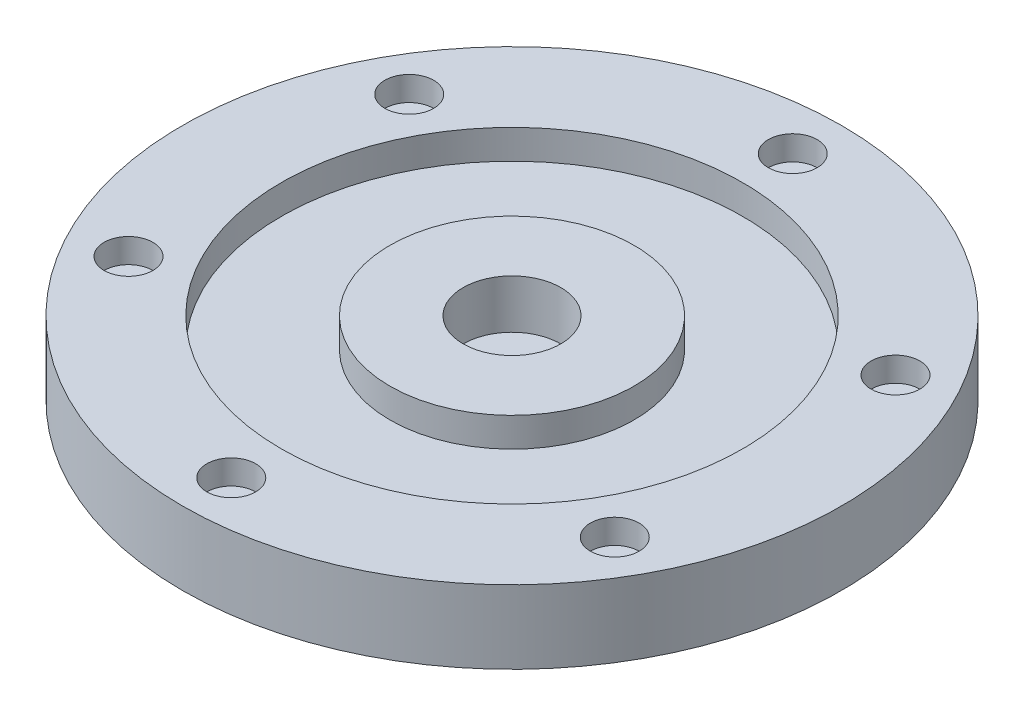
ISO-10303-21;
HEADER;
FILE_DESCRIPTION(('STEP AP214'),'2;1');
FILE_NAME('part.step','',(''),(''),'','','');
FILE_SCHEMA(('AUTOMOTIVE_DESIGN { 1 0 10303 214 1 1 1 1 }'));
ENDSEC;
DATA;
#1=APPLICATION_CONTEXT('core data for automotive mechanical design processes');
#2=APPLICATION_PROTOCOL_DEFINITION('international standard','automotive_design',2000,#1);
#3=PRODUCT_CONTEXT('',#1,'mechanical');
#4=PRODUCT('Part','Part','',(#3));
#5=PRODUCT_RELATED_PRODUCT_CATEGORY('part','',(#4));
#6=PRODUCT_DEFINITION_FORMATION('','',#4);
#7=PRODUCT_DEFINITION_CONTEXT('part definition',#1,'design');
#8=PRODUCT_DEFINITION('design','',#6,#7);
#9=PRODUCT_DEFINITION_SHAPE('','',#8);
#10=(LENGTH_UNIT() NAMED_UNIT(*) SI_UNIT(.MILLI.,.METRE.));
#11=(NAMED_UNIT(*) PLANE_ANGLE_UNIT() SI_UNIT($,.RADIAN.));
#12=(NAMED_UNIT(*) SI_UNIT($,.STERADIAN.) SOLID_ANGLE_UNIT());
#13=UNCERTAINTY_MEASURE_WITH_UNIT(LENGTH_MEASURE(1.E-05),#10,'distance_accuracy_value','');
#14=(GEOMETRIC_REPRESENTATION_CONTEXT(3) GLOBAL_UNCERTAINTY_ASSIGNED_CONTEXT((#13)) GLOBAL_UNIT_ASSIGNED_CONTEXT((#10,
#11,#12)) REPRESENTATION_CONTEXT('',''));
#15=CARTESIAN_POINT('',(0.,0.,0.));
#16=DIRECTION('',(0.,0.,1.));
#17=DIRECTION('',(1.,0.,0.));
#18=AXIS2_PLACEMENT_3D('',#15,#16,#17);
#19=CARTESIAN_POINT('',(-49.796460717604,0.,-28.7499999999978));
#20=DIRECTION('',(0.,1.,0.));
#21=DIRECTION('',(0.,0.,1.));
#22=AXIS2_PLACEMENT_3D('',#19,#20,#21);
#23=CYLINDRICAL_SURFACE('',#22,2.00000000000247);
#24=CARTESIAN_POINT('',(-49.796460717604,0.,-28.7499999999978));
#25=DIRECTION('',(0.,1.,0.));
#26=DIRECTION('',(0.,0.,1.));
#27=AXIS2_PLACEMENT_3D('',#24,#25,#26);
#28=CIRCLE('',#27,2.00000000000247);
#29=CARTESIAN_POINT('',(-49.796460717604,0.,-26.7499999999954));
#30=VERTEX_POINT('',#29);
#31=EDGE_CURVE('E57',#30,#30,#28,.T.);
#32=ORIENTED_EDGE('',*,*,#31,.F.);
#33=EDGE_LOOP('',(#32));
#34=FACE_BOUND('',#33,.T.);
#35=CARTESIAN_POINT('',(-49.796460717604,10.,-28.7499999999978));
#36=DIRECTION('',(0.,1.,0.));
#37=DIRECTION('',(0.,0.,1.));
#38=AXIS2_PLACEMENT_3D('',#35,#36,#37);
#39=CIRCLE('',#38,2.00000000000247);
#40=CARTESIAN_POINT('',(-49.796460717604,10.,-26.7499999999954));
#41=VERTEX_POINT('',#40);
#42=EDGE_CURVE('E39',#41,#41,#39,.F.);
#43=ORIENTED_EDGE('',*,*,#42,.F.);
#44=EDGE_LOOP('',(#43));
#45=FACE_BOUND('',#44,.T.);
#46=ADVANCED_FACE('F35',(#34,#45),#23,.F.);
#47=CARTESIAN_POINT('',(-49.7964607176015,0.,28.7500000000021));
#48=DIRECTION('',(0.,1.,0.));
#49=DIRECTION('',(0.,0.,1.));
#50=AXIS2_PLACEMENT_3D('',#47,#48,#49);
#51=CYLINDRICAL_SURFACE('',#50,2.00000000000465);
#52=CARTESIAN_POINT('',(-49.7964607176015,0.,28.7500000000021));
#53=DIRECTION('',(0.,1.,0.));
#54=DIRECTION('',(0.,0.,1.));
#55=AXIS2_PLACEMENT_3D('',#52,#53,#54);
#56=CIRCLE('',#55,2.00000000000465);
#57=CARTESIAN_POINT('',(-49.7964607176015,0.,30.7500000000068));
#58=VERTEX_POINT('',#57);
#59=EDGE_CURVE('E94',#58,#58,#56,.T.);
#60=ORIENTED_EDGE('',*,*,#59,.F.);
#61=EDGE_LOOP('',(#60));
#62=FACE_BOUND('',#61,.T.);
#63=CARTESIAN_POINT('',(-49.7964607176015,10.,28.7500000000021));
#64=DIRECTION('',(0.,1.,0.));
#65=DIRECTION('',(0.,0.,1.));
#66=AXIS2_PLACEMENT_3D('',#63,#64,#65);
#67=CIRCLE('',#66,2.00000000000465);
#68=CARTESIAN_POINT('',(-49.7964607176015,10.,30.7500000000068));
#69=VERTEX_POINT('',#68);
#70=EDGE_CURVE('E68',#69,#69,#67,.F.);
#71=ORIENTED_EDGE('',*,*,#70,.F.);
#72=EDGE_LOOP('',(#71));
#73=FACE_BOUND('',#72,.T.);
#74=ADVANCED_FACE('F147',(#62,#73),#51,.F.);
#75=CARTESIAN_POINT('',(4.8886614385545E-12,0.,57.5));
#76=DIRECTION('',(0.,1.,0.));
#77=DIRECTION('',(0.,0.,1.));
#78=AXIS2_PLACEMENT_3D('',#75,#76,#77);
#79=CYLINDRICAL_SURFACE('',#78,2.00000000000506);
#80=CARTESIAN_POINT('',(4.8886614385545E-12,0.,57.5));
#81=DIRECTION('',(0.,1.,0.));
#82=DIRECTION('',(0.,0.,1.));
#83=AXIS2_PLACEMENT_3D('',#80,#81,#82);
#84=CIRCLE('',#83,2.00000000000506);
#85=CARTESIAN_POINT('',(4.8886614385545E-12,0.,59.5000000000051));
#86=VERTEX_POINT('',#85);
#87=EDGE_CURVE('E91',#86,#86,#84,.T.);
#88=ORIENTED_EDGE('',*,*,#87,.F.);
#89=EDGE_LOOP('',(#88));
#90=FACE_BOUND('',#89,.T.);
#91=CARTESIAN_POINT('',(4.8886614385545E-12,10.,57.5));
#92=DIRECTION('',(0.,1.,0.));
#93=DIRECTION('',(0.,0.,1.));
#94=AXIS2_PLACEMENT_3D('',#91,#92,#93);
#95=CIRCLE('',#94,2.00000000000506);
#96=CARTESIAN_POINT('',(4.8886614385545E-12,10.,59.5000000000051));
#97=VERTEX_POINT('',#96);
#98=EDGE_CURVE('E66',#97,#97,#95,.F.);
#99=ORIENTED_EDGE('',*,*,#98,.F.);
#100=EDGE_LOOP('',(#99));
#101=FACE_BOUND('',#100,.T.);
#102=ADVANCED_FACE('F153',(#90,#101),#79,.F.);
#103=CARTESIAN_POINT('',(49.7964607176089,0.,28.7499999999979));
#104=DIRECTION('',(0.,1.,0.));
#105=DIRECTION('',(0.,0.,1.));
#106=AXIS2_PLACEMENT_3D('',#103,#104,#105);
#107=CYLINDRICAL_SURFACE('',#106,2.00000000000315);
#108=CARTESIAN_POINT('',(49.7964607176089,0.,28.7499999999979));
#109=DIRECTION('',(0.,1.,0.));
#110=DIRECTION('',(0.,0.,1.));
#111=AXIS2_PLACEMENT_3D('',#108,#109,#110);
#112=CIRCLE('',#111,2.00000000000315);
#113=CARTESIAN_POINT('',(49.7964607176089,0.,30.750000000001));
#114=VERTEX_POINT('',#113);
#115=EDGE_CURVE('E88',#114,#114,#112,.T.);
#116=ORIENTED_EDGE('',*,*,#115,.F.);
#117=EDGE_LOOP('',(#116));
#118=FACE_BOUND('',#117,.T.);
#119=CARTESIAN_POINT('',(49.7964607176089,10.,28.7499999999979));
#120=DIRECTION('',(0.,1.,0.));
#121=DIRECTION('',(0.,0.,1.));
#122=AXIS2_PLACEMENT_3D('',#119,#120,#121);
#123=CIRCLE('',#122,2.00000000000315);
#124=CARTESIAN_POINT('',(49.7964607176089,10.,30.750000000001));
#125=VERTEX_POINT('',#124);
#126=EDGE_CURVE('E62',#125,#125,#123,.F.);
#127=ORIENTED_EDGE('',*,*,#126,.F.);
#128=EDGE_LOOP('',(#127));
#129=FACE_BOUND('',#128,.T.);
#130=ADVANCED_FACE('F349',(#118,#129),#107,.F.);
#131=CARTESIAN_POINT('',(49.7964607176064,0.,-28.7500000000021));
#132=DIRECTION('',(0.,1.,0.));
#133=DIRECTION('',(0.,0.,1.));
#134=AXIS2_PLACEMENT_3D('',#131,#132,#133);
#135=CYLINDRICAL_SURFACE('',#134,2.0000000000007);
#136=CARTESIAN_POINT('',(49.7964607176064,0.,-28.7500000000021));
#137=DIRECTION('',(0.,1.,0.));
#138=DIRECTION('',(0.,0.,1.));
#139=AXIS2_PLACEMENT_3D('',#136,#137,#138);
#140=CIRCLE('',#139,2.0000000000007);
#141=CARTESIAN_POINT('',(49.7964607176064,0.,-26.7500000000014));
#142=VERTEX_POINT('',#141);
#143=EDGE_CURVE('E84',#142,#142,#140,.T.);
#144=ORIENTED_EDGE('',*,*,#143,.F.);
#145=EDGE_LOOP('',(#144));
#146=FACE_BOUND('',#145,.T.);
#147=CARTESIAN_POINT('',(49.7964607176064,10.,-28.7500000000021));
#148=DIRECTION('',(0.,1.,0.));
#149=DIRECTION('',(0.,0.,1.));
#150=AXIS2_PLACEMENT_3D('',#147,#148,#149);
#151=CIRCLE('',#150,2.0000000000007);
#152=CARTESIAN_POINT('',(49.7964607176064,10.,-26.7500000000014));
#153=VERTEX_POINT('',#152);
#154=EDGE_CURVE('E59',#153,#153,#151,.F.);
#155=ORIENTED_EDGE('',*,*,#154,.F.);
#156=EDGE_LOOP('',(#155));
#157=FACE_BOUND('',#156,.T.);
#158=ADVANCED_FACE('F162',(#146,#157),#135,.F.);
#159=CARTESIAN_POINT('',(0.,0.,-57.5));
#160=DIRECTION('',(0.,1.,0.));
#161=DIRECTION('',(0.,0.,1.));
#162=AXIS2_PLACEMENT_3D('',#159,#160,#161);
#163=CYLINDRICAL_SURFACE('',#162,2.);
#164=CARTESIAN_POINT('',(0.,0.,-57.5));
#165=DIRECTION('',(0.,1.,0.));
#166=DIRECTION('',(0.,0.,1.));
#167=AXIS2_PLACEMENT_3D('',#164,#165,#166);
#168=CIRCLE('',#167,2.);
#169=CARTESIAN_POINT('',(0.,0.,-55.5));
#170=VERTEX_POINT('',#169);
#171=EDGE_CURVE('E87',#170,#170,#168,.T.);
#172=ORIENTED_EDGE('',*,*,#171,.F.);
#173=EDGE_LOOP('',(#172));
#174=FACE_BOUND('',#173,.T.);
#175=CARTESIAN_POINT('',(0.,10.,-57.5));
#176=DIRECTION('',(0.,1.,0.));
#177=DIRECTION('',(0.,0.,1.));
#178=AXIS2_PLACEMENT_3D('',#175,#176,#177);
#179=CIRCLE('',#178,2.);
#180=CARTESIAN_POINT('',(0.,10.,-55.5));
#181=VERTEX_POINT('',#180);
#182=EDGE_CURVE('E54',#181,#181,#179,.F.);
#183=ORIENTED_EDGE('',*,*,#182,.F.);
#184=EDGE_LOOP('',(#183));
#185=FACE_BOUND('',#184,.T.);
#186=ADVANCED_FACE('F137',(#174,#185),#163,.F.);
#187=CARTESIAN_POINT('',(0.,15.,0.));
#188=DIRECTION('',(0.,-1.,0.));
#189=DIRECTION('',(0.,0.,-1.));
#190=AXIS2_PLACEMENT_3D('',#187,#188,#189);
#191=CYLINDRICAL_SURFACE('',#190,67.5);
#192=CARTESIAN_POINT('',(0.,15.,0.));
#193=DIRECTION('',(0.,1.,0.));
#194=DIRECTION('',(0.,0.,1.));
#195=AXIS2_PLACEMENT_3D('',#192,#193,#194);
#196=CIRCLE('',#195,67.5);
#197=CARTESIAN_POINT('',(0.,15.,67.5));
#198=VERTEX_POINT('',#197);
#199=EDGE_CURVE('E10',#198,#198,#196,.T.);
#200=ORIENTED_EDGE('',*,*,#199,.F.);
#201=EDGE_LOOP('',(#200));
#202=FACE_BOUND('',#201,.T.);
#203=CARTESIAN_POINT('',(0.,0.,0.));
#204=DIRECTION('',(0.,1.,0.));
#205=DIRECTION('',(0.,0.,1.));
#206=AXIS2_PLACEMENT_3D('',#203,#204,#205);
#207=CIRCLE('',#206,67.5);
#208=CARTESIAN_POINT('',(0.,0.,67.5));
#209=VERTEX_POINT('',#208);
#210=EDGE_CURVE('E43',#209,#209,#207,.T.);
#211=ORIENTED_EDGE('',*,*,#210,.T.);
#212=EDGE_LOOP('',(#211));
#213=FACE_BOUND('',#212,.T.);
#214=ADVANCED_FACE('F37',(#202,#213),#191,.T.);
#215=CARTESIAN_POINT('',(0.,15.,0.));
#216=DIRECTION('',(0.,1.,0.));
#217=DIRECTION('',(0.,0.,1.));
#218=AXIS2_PLACEMENT_3D('',#215,#216,#217);
#219=PLANE('',#218);
#220=CARTESIAN_POINT('',(49.7964607176064,15.,-28.7500000000021));
#221=DIRECTION('',(0.,1.,0.));
#222=DIRECTION('',(0.,0.,1.));
#223=AXIS2_PLACEMENT_3D('',#220,#221,#222);
#224=CIRCLE('',#223,5.0000000000007);
#225=CARTESIAN_POINT('',(49.7964607176064,15.,-23.7500000000014));
#226=VERTEX_POINT('',#225);
#227=EDGE_CURVE('E461',#226,#226,#224,.T.);
#228=ORIENTED_EDGE('',*,*,#227,.F.);
#229=EDGE_LOOP('',(#228));
#230=FACE_BOUND('',#229,.T.);
#231=CARTESIAN_POINT('',(49.7964607176089,15.,28.7499999999979));
#232=DIRECTION('',(0.,1.,0.));
#233=DIRECTION('',(0.,0.,1.));
#234=AXIS2_PLACEMENT_3D('',#231,#232,#233);
#235=CIRCLE('',#234,5.00000000000315);
#236=CARTESIAN_POINT('',(49.7964607176089,15.,33.750000000001));
#237=VERTEX_POINT('',#236);
#238=EDGE_CURVE('E455',#237,#237,#235,.T.);
#239=ORIENTED_EDGE('',*,*,#238,.F.);
#240=EDGE_LOOP('',(#239));
#241=FACE_BOUND('',#240,.T.);
#242=CARTESIAN_POINT('',(4.8886614385545E-12,15.,57.5));
#243=DIRECTION('',(0.,1.,0.));
#244=DIRECTION('',(0.,0.,1.));
#245=AXIS2_PLACEMENT_3D('',#242,#243,#244);
#246=CIRCLE('',#245,5.00000000000506);
#247=CARTESIAN_POINT('',(4.8886614385545E-12,15.,62.5000000000051));
#248=VERTEX_POINT('',#247);
#249=EDGE_CURVE('E449',#248,#248,#246,.T.);
#250=ORIENTED_EDGE('',*,*,#249,.F.);
#251=EDGE_LOOP('',(#250));
#252=FACE_BOUND('',#251,.T.);
#253=CARTESIAN_POINT('',(-49.7964607176015,15.,28.7500000000021));
#254=DIRECTION('',(0.,1.,0.));
#255=DIRECTION('',(0.,0.,1.));
#256=AXIS2_PLACEMENT_3D('',#253,#254,#255);
#257=CIRCLE('',#256,5.00000000000465);
#258=CARTESIAN_POINT('',(-49.7964607176015,15.,33.7500000000068));
#259=VERTEX_POINT('',#258);
#260=EDGE_CURVE('E441',#259,#259,#257,.T.);
#261=ORIENTED_EDGE('',*,*,#260,.F.);
#262=EDGE_LOOP('',(#261));
#263=FACE_BOUND('',#262,.T.);
#264=CARTESIAN_POINT('',(-49.796460717604,15.,-28.7499999999978));
#265=DIRECTION('',(0.,1.,0.));
#266=DIRECTION('',(0.,0.,1.));
#267=AXIS2_PLACEMENT_3D('',#264,#265,#266);
#268=CIRCLE('',#267,5.00000000000247);
#269=CARTESIAN_POINT('',(-49.796460717604,15.,-23.7499999999954));
#270=VERTEX_POINT('',#269);
#271=EDGE_CURVE('E439',#270,#270,#268,.T.);
#272=ORIENTED_EDGE('',*,*,#271,.F.);
#273=EDGE_LOOP('',(#272));
#274=FACE_BOUND('',#273,.T.);
#275=CARTESIAN_POINT('',(0.,15.,-57.5));
#276=DIRECTION('',(0.,1.,0.));
#277=DIRECTION('',(0.,0.,1.));
#278=AXIS2_PLACEMENT_3D('',#275,#276,#277);
#279=CIRCLE('',#278,5.);
#280=CARTESIAN_POINT('',(0.,15.,-52.5));
#281=VERTEX_POINT('',#280);
#282=EDGE_CURVE('E73',#281,#281,#279,.T.);
#283=ORIENTED_EDGE('',*,*,#282,.F.);
#284=EDGE_LOOP('',(#283));
#285=FACE_BOUND('',#284,.T.);
#286=CARTESIAN_POINT('',(0.,15.,0.));
#287=DIRECTION('',(0.,1.,0.));
#288=DIRECTION('',(0.,0.,1.));
#289=AXIS2_PLACEMENT_3D('',#286,#287,#288);
#290=CIRCLE('',#289,47.25);
#291=CARTESIAN_POINT('',(0.,15.,47.25));
#292=VERTEX_POINT('',#291);
#293=EDGE_CURVE('E51',#292,#292,#290,.T.);
#294=ORIENTED_EDGE('',*,*,#293,.F.);
#295=EDGE_LOOP('',(#294));
#296=FACE_BOUND('',#295,.T.);
#297=ORIENTED_EDGE('',*,*,#199,.T.);
#298=EDGE_LOOP('',(#297));
#299=FACE_BOUND('',#298,.T.);
#300=ADVANCED_FACE('F126',(#230,#241,#252,#263,#274,#285,#296,#299),#219,.T.);
#301=CARTESIAN_POINT('',(0.,0.,0.));
#302=DIRECTION('',(0.,1.,0.));
#303=DIRECTION('',(0.,0.,1.));
#304=AXIS2_PLACEMENT_3D('',#301,#302,#303);
#305=PLANE('',#304);
#306=ORIENTED_EDGE('',*,*,#143,.T.);
#307=EDGE_LOOP('',(#306));
#308=FACE_BOUND('',#307,.T.);
#309=ORIENTED_EDGE('',*,*,#115,.T.);
#310=EDGE_LOOP('',(#309));
#311=FACE_BOUND('',#310,.T.);
#312=ORIENTED_EDGE('',*,*,#87,.T.);
#313=EDGE_LOOP('',(#312));
#314=FACE_BOUND('',#313,.T.);
#315=ORIENTED_EDGE('',*,*,#59,.T.);
#316=EDGE_LOOP('',(#315));
#317=FACE_BOUND('',#316,.T.);
#318=ORIENTED_EDGE('',*,*,#31,.T.);
#319=EDGE_LOOP('',(#318));
#320=FACE_BOUND('',#319,.T.);
#321=ORIENTED_EDGE('',*,*,#171,.T.);
#322=EDGE_LOOP('',(#321));
#323=FACE_BOUND('',#322,.T.);
#324=CARTESIAN_POINT('',(0.,0.,0.));
#325=DIRECTION('',(0.,1.,0.));
#326=DIRECTION('',(0.,0.,1.));
#327=AXIS2_PLACEMENT_3D('',#324,#325,#326);
#328=CIRCLE('',#327,2.5);
#329=CARTESIAN_POINT('',(0.,0.,2.5));
#330=VERTEX_POINT('',#329);
#331=EDGE_CURVE('E104',#330,#330,#328,.T.);
#332=ORIENTED_EDGE('',*,*,#331,.T.);
#333=EDGE_LOOP('',(#332));
#334=FACE_BOUND('',#333,.T.);
#335=ORIENTED_EDGE('',*,*,#210,.F.);
#336=EDGE_LOOP('',(#335));
#337=FACE_BOUND('',#336,.T.);
#338=ADVANCED_FACE('F128',(#308,#311,#314,#317,#320,#323,#334,#337),#305,.F.);
#339=CARTESIAN_POINT('',(0.,9.,0.));
#340=DIRECTION('',(0.,1.,0.));
#341=DIRECTION('',(0.,0.,1.));
#342=AXIS2_PLACEMENT_3D('',#339,#340,#341);
#343=CYLINDRICAL_SURFACE('',#342,47.25);
#344=CARTESIAN_POINT('',(0.,9.,0.));
#345=DIRECTION('',(0.,1.,0.));
#346=DIRECTION('',(0.,0.,1.));
#347=AXIS2_PLACEMENT_3D('',#344,#345,#346);
#348=CIRCLE('',#347,47.25);
#349=CARTESIAN_POINT('',(0.,9.,47.25));
#350=VERTEX_POINT('',#349);
#351=EDGE_CURVE('E48',#350,#350,#348,.T.);
#352=ORIENTED_EDGE('',*,*,#351,.F.);
#353=EDGE_LOOP('',(#352));
#354=FACE_BOUND('',#353,.T.);
#355=ORIENTED_EDGE('',*,*,#293,.T.);
#356=EDGE_LOOP('',(#355));
#357=FACE_BOUND('',#356,.T.);
#358=ADVANCED_FACE('F124',(#354,#357),#343,.F.);
#359=CARTESIAN_POINT('',(0.,9.,0.));
#360=DIRECTION('',(0.,1.,0.));
#361=DIRECTION('',(0.,0.,1.));
#362=AXIS2_PLACEMENT_3D('',#359,#360,#361);
#363=PLANE('',#362);
#364=CARTESIAN_POINT('',(0.,9.,0.));
#365=DIRECTION('',(0.,1.,0.));
#366=DIRECTION('',(0.,0.,1.));
#367=AXIS2_PLACEMENT_3D('',#364,#365,#366);
#368=CIRCLE('',#367,25.);
#369=CARTESIAN_POINT('',(0.,9.,25.));
#370=VERTEX_POINT('',#369);
#371=EDGE_CURVE('E114',#370,#370,#368,.T.);
#372=ORIENTED_EDGE('',*,*,#371,.F.);
#373=EDGE_LOOP('',(#372));
#374=FACE_BOUND('',#373,.T.);
#375=ORIENTED_EDGE('',*,*,#351,.T.);
#376=EDGE_LOOP('',(#375));
#377=FACE_BOUND('',#376,.T.);
#378=ADVANCED_FACE('F178',(#374,#377),#363,.T.);
#379=CARTESIAN_POINT('',(0.,9.,0.));
#380=DIRECTION('',(0.,1.,0.));
#381=DIRECTION('',(0.,0.,1.));
#382=AXIS2_PLACEMENT_3D('',#379,#380,#381);
#383=CYLINDRICAL_SURFACE('',#382,25.);
#384=ORIENTED_EDGE('',*,*,#371,.T.);
#385=EDGE_LOOP('',(#384));
#386=FACE_BOUND('',#385,.T.);
#387=CARTESIAN_POINT('',(0.,15.,0.));
#388=DIRECTION('',(0.,1.,0.));
#389=DIRECTION('',(0.,0.,1.));
#390=AXIS2_PLACEMENT_3D('',#387,#388,#389);
#391=CIRCLE('',#390,25.);
#392=CARTESIAN_POINT('',(0.,15.,25.));
#393=VERTEX_POINT('',#392);
#394=EDGE_CURVE('E111',#393,#393,#391,.T.);
#395=ORIENTED_EDGE('',*,*,#394,.F.);
#396=EDGE_LOOP('',(#395));
#397=FACE_BOUND('',#396,.T.);
#398=ADVANCED_FACE('F144',(#386,#397),#383,.T.);
#399=CARTESIAN_POINT('',(0.,15.,0.));
#400=DIRECTION('',(0.,1.,0.));
#401=DIRECTION('',(0.,0.,1.));
#402=AXIS2_PLACEMENT_3D('',#399,#400,#401);
#403=CIRCLE('',#402,10.);
#404=CARTESIAN_POINT('',(0.,15.,10.));
#405=VERTEX_POINT('',#404);
#406=EDGE_CURVE('E107',#405,#405,#403,.T.);
#407=ORIENTED_EDGE('',*,*,#406,.F.);
#408=EDGE_LOOP('',(#407));
#409=FACE_BOUND('',#408,.T.);
#410=ORIENTED_EDGE('',*,*,#394,.T.);
#411=EDGE_LOOP('',(#410));
#412=FACE_BOUND('',#411,.T.);
#413=ADVANCED_FACE('F131',(#409,#412),#219,.T.);
#414=CARTESIAN_POINT('',(0.,5.,0.));
#415=DIRECTION('',(0.,1.,0.));
#416=DIRECTION('',(0.,0.,1.));
#417=AXIS2_PLACEMENT_3D('',#414,#415,#416);
#418=CYLINDRICAL_SURFACE('',#417,10.);
#419=CARTESIAN_POINT('',(0.,5.,0.));
#420=DIRECTION('',(0.,1.,0.));
#421=DIRECTION('',(0.,0.,1.));
#422=AXIS2_PLACEMENT_3D('',#419,#420,#421);
#423=CIRCLE('',#422,10.);
#424=CARTESIAN_POINT('',(0.,5.,10.));
#425=VERTEX_POINT('',#424);
#426=EDGE_CURVE('E108',#425,#425,#423,.T.);
#427=ORIENTED_EDGE('',*,*,#426,.F.);
#428=EDGE_LOOP('',(#427));
#429=FACE_BOUND('',#428,.T.);
#430=ORIENTED_EDGE('',*,*,#406,.T.);
#431=EDGE_LOOP('',(#430));
#432=FACE_BOUND('',#431,.T.);
#433=ADVANCED_FACE('F143',(#429,#432),#418,.F.);
#434=CARTESIAN_POINT('',(0.,5.,0.));
#435=DIRECTION('',(0.,1.,0.));
#436=DIRECTION('',(0.,0.,1.));
#437=AXIS2_PLACEMENT_3D('',#434,#435,#436);
#438=PLANE('',#437);
#439=CARTESIAN_POINT('',(0.,5.,0.));
#440=DIRECTION('',(0.,1.,0.));
#441=DIRECTION('',(0.,0.,1.));
#442=AXIS2_PLACEMENT_3D('',#439,#440,#441);
#443=CIRCLE('',#442,2.5);
#444=CARTESIAN_POINT('',(0.,5.,2.5));
#445=VERTEX_POINT('',#444);
#446=EDGE_CURVE('E101',#445,#445,#443,.T.);
#447=ORIENTED_EDGE('',*,*,#446,.F.);
#448=EDGE_LOOP('',(#447));
#449=FACE_BOUND('',#448,.T.);
#450=ORIENTED_EDGE('',*,*,#426,.T.);
#451=EDGE_LOOP('',(#450));
#452=FACE_BOUND('',#451,.T.);
#453=ADVANCED_FACE('F168',(#449,#452),#438,.T.);
#454=CARTESIAN_POINT('',(0.,-5.,0.));
#455=DIRECTION('',(0.,1.,0.));
#456=DIRECTION('',(0.,0.,1.));
#457=AXIS2_PLACEMENT_3D('',#454,#455,#456);
#458=CYLINDRICAL_SURFACE('',#457,2.5);
#459=ORIENTED_EDGE('',*,*,#446,.T.);
#460=EDGE_LOOP('',(#459));
#461=FACE_BOUND('',#460,.T.);
#462=ORIENTED_EDGE('',*,*,#331,.F.);
#463=EDGE_LOOP('',(#462));
#464=FACE_BOUND('',#463,.T.);
#465=ADVANCED_FACE('F164',(#461,#464),#458,.F.);
#466=CARTESIAN_POINT('',(0.,10.,-57.5));
#467=DIRECTION('',(0.,1.,0.));
#468=DIRECTION('',(0.,0.,1.));
#469=AXIS2_PLACEMENT_3D('',#466,#467,#468);
#470=PLANE('',#469);
#471=CARTESIAN_POINT('',(0.,10.,-57.5));
#472=DIRECTION('',(0.,1.,0.));
#473=DIRECTION('',(0.,0.,1.));
#474=AXIS2_PLACEMENT_3D('',#471,#472,#473);
#475=CIRCLE('',#474,5.);
#476=CARTESIAN_POINT('',(0.,10.,-52.5));
#477=VERTEX_POINT('',#476);
#478=EDGE_CURVE('E58',#477,#477,#475,.T.);
#479=ORIENTED_EDGE('',*,*,#478,.T.);
#480=EDGE_LOOP('',(#479));
#481=FACE_BOUND('',#480,.T.);
#482=ORIENTED_EDGE('',*,*,#182,.T.);
#483=EDGE_LOOP('',(#482));
#484=FACE_BOUND('',#483,.T.);
#485=ADVANCED_FACE('F167',(#481,#484),#470,.T.);
#486=CARTESIAN_POINT('',(0.,10.,-57.5));
#487=DIRECTION('',(0.,1.,0.));
#488=DIRECTION('',(0.,0.,1.));
#489=AXIS2_PLACEMENT_3D('',#486,#487,#488);
#490=CYLINDRICAL_SURFACE('',#489,5.);
#491=ORIENTED_EDGE('',*,*,#478,.F.);
#492=EDGE_LOOP('',(#491));
#493=FACE_BOUND('',#492,.T.);
#494=ORIENTED_EDGE('',*,*,#282,.T.);
#495=EDGE_LOOP('',(#494));
#496=FACE_BOUND('',#495,.T.);
#497=ADVANCED_FACE('F219',(#493,#496),#490,.F.);
#498=CARTESIAN_POINT('',(49.7964607176064,10.,-28.7500000000021));
#499=DIRECTION('',(0.,1.,0.));
#500=DIRECTION('',(0.,0.,1.));
#501=AXIS2_PLACEMENT_3D('',#498,#499,#500);
#502=PLANE('',#501);
#503=CARTESIAN_POINT('',(49.7964607176064,10.,-28.7500000000021));
#504=DIRECTION('',(0.,1.,0.));
#505=DIRECTION('',(0.,0.,1.));
#506=AXIS2_PLACEMENT_3D('',#503,#504,#505);
#507=CIRCLE('',#506,5.0000000000007);
#508=CARTESIAN_POINT('',(49.7964607176064,10.,-23.7500000000014));
#509=VERTEX_POINT('',#508);
#510=EDGE_CURVE('E63',#509,#509,#507,.T.);
#511=ORIENTED_EDGE('',*,*,#510,.T.);
#512=EDGE_LOOP('',(#511));
#513=FACE_BOUND('',#512,.T.);
#514=ORIENTED_EDGE('',*,*,#154,.T.);
#515=EDGE_LOOP('',(#514));
#516=FACE_BOUND('',#515,.T.);
#517=ADVANCED_FACE('F227',(#513,#516),#502,.T.);
#518=CARTESIAN_POINT('',(49.7964607176064,10.,-28.7500000000021));
#519=DIRECTION('',(0.,1.,0.));
#520=DIRECTION('',(0.,0.,1.));
#521=AXIS2_PLACEMENT_3D('',#518,#519,#520);
#522=CYLINDRICAL_SURFACE('',#521,5.0000000000007);
#523=ORIENTED_EDGE('',*,*,#510,.F.);
#524=EDGE_LOOP('',(#523));
#525=FACE_BOUND('',#524,.T.);
#526=ORIENTED_EDGE('',*,*,#227,.T.);
#527=EDGE_LOOP('',(#526));
#528=FACE_BOUND('',#527,.T.);
#529=ADVANCED_FACE('F235',(#525,#528),#522,.F.);
#530=CARTESIAN_POINT('',(49.7964607176089,10.,28.7499999999979));
#531=DIRECTION('',(0.,1.,0.));
#532=DIRECTION('',(0.,0.,1.));
#533=AXIS2_PLACEMENT_3D('',#530,#531,#532);
#534=PLANE('',#533);
#535=CARTESIAN_POINT('',(49.7964607176089,10.,28.7499999999979));
#536=DIRECTION('',(0.,1.,0.));
#537=DIRECTION('',(0.,0.,1.));
#538=AXIS2_PLACEMENT_3D('',#535,#536,#537);
#539=CIRCLE('',#538,5.00000000000315);
#540=CARTESIAN_POINT('',(49.7964607176089,10.,33.750000000001));
#541=VERTEX_POINT('',#540);
#542=EDGE_CURVE('E458',#541,#541,#539,.T.);
#543=ORIENTED_EDGE('',*,*,#542,.T.);
#544=EDGE_LOOP('',(#543));
#545=FACE_BOUND('',#544,.T.);
#546=ORIENTED_EDGE('',*,*,#126,.T.);
#547=EDGE_LOOP('',(#546));
#548=FACE_BOUND('',#547,.T.);
#549=ADVANCED_FACE('F243',(#545,#548),#534,.T.);
#550=CARTESIAN_POINT('',(49.7964607176089,10.,28.7499999999979));
#551=DIRECTION('',(0.,1.,0.));
#552=DIRECTION('',(0.,0.,1.));
#553=AXIS2_PLACEMENT_3D('',#550,#551,#552);
#554=CYLINDRICAL_SURFACE('',#553,5.00000000000315);
#555=ORIENTED_EDGE('',*,*,#542,.F.);
#556=EDGE_LOOP('',(#555));
#557=FACE_BOUND('',#556,.T.);
#558=ORIENTED_EDGE('',*,*,#238,.T.);
#559=EDGE_LOOP('',(#558));
#560=FACE_BOUND('',#559,.T.);
#561=ADVANCED_FACE('F251',(#557,#560),#554,.F.);
#562=CARTESIAN_POINT('',(4.8886614385545E-12,10.,57.5));
#563=DIRECTION('',(0.,1.,0.));
#564=DIRECTION('',(0.,0.,1.));
#565=AXIS2_PLACEMENT_3D('',#562,#563,#564);
#566=PLANE('',#565);
#567=CARTESIAN_POINT('',(4.8886614385545E-12,10.,57.5));
#568=DIRECTION('',(0.,1.,0.));
#569=DIRECTION('',(0.,0.,1.));
#570=AXIS2_PLACEMENT_3D('',#567,#568,#569);
#571=CIRCLE('',#570,5.00000000000506);
#572=CARTESIAN_POINT('',(4.8886614385545E-12,10.,62.5000000000051));
#573=VERTEX_POINT('',#572);
#574=EDGE_CURVE('E452',#573,#573,#571,.T.);
#575=ORIENTED_EDGE('',*,*,#574,.T.);
#576=EDGE_LOOP('',(#575));
#577=FACE_BOUND('',#576,.T.);
#578=ORIENTED_EDGE('',*,*,#98,.T.);
#579=EDGE_LOOP('',(#578));
#580=FACE_BOUND('',#579,.T.);
#581=ADVANCED_FACE('F259',(#577,#580),#566,.T.);
#582=CARTESIAN_POINT('',(4.8886614385545E-12,10.,57.5));
#583=DIRECTION('',(0.,1.,0.));
#584=DIRECTION('',(0.,0.,1.));
#585=AXIS2_PLACEMENT_3D('',#582,#583,#584);
#586=CYLINDRICAL_SURFACE('',#585,5.00000000000506);
#587=ORIENTED_EDGE('',*,*,#574,.F.);
#588=EDGE_LOOP('',(#587));
#589=FACE_BOUND('',#588,.T.);
#590=ORIENTED_EDGE('',*,*,#249,.T.);
#591=EDGE_LOOP('',(#590));
#592=FACE_BOUND('',#591,.T.);
#593=ADVANCED_FACE('F267',(#589,#592),#586,.F.);
#594=CARTESIAN_POINT('',(-49.7964607176015,10.,28.7500000000021));
#595=DIRECTION('',(0.,1.,0.));
#596=DIRECTION('',(0.,0.,1.));
#597=AXIS2_PLACEMENT_3D('',#594,#595,#596);
#598=PLANE('',#597);
#599=CARTESIAN_POINT('',(-49.7964607176015,10.,28.7500000000021));
#600=DIRECTION('',(0.,1.,0.));
#601=DIRECTION('',(0.,0.,1.));
#602=AXIS2_PLACEMENT_3D('',#599,#600,#601);
#603=CIRCLE('',#602,5.00000000000465);
#604=CARTESIAN_POINT('',(-49.7964607176015,10.,33.7500000000068));
#605=VERTEX_POINT('',#604);
#606=EDGE_CURVE('E446',#605,#605,#603,.T.);
#607=ORIENTED_EDGE('',*,*,#606,.T.);
#608=EDGE_LOOP('',(#607));
#609=FACE_BOUND('',#608,.T.);
#610=ORIENTED_EDGE('',*,*,#70,.T.);
#611=EDGE_LOOP('',(#610));
#612=FACE_BOUND('',#611,.T.);
#613=ADVANCED_FACE('F275',(#609,#612),#598,.T.);
#614=CARTESIAN_POINT('',(-49.7964607176015,10.,28.7500000000021));
#615=DIRECTION('',(0.,1.,0.));
#616=DIRECTION('',(0.,0.,1.));
#617=AXIS2_PLACEMENT_3D('',#614,#615,#616);
#618=CYLINDRICAL_SURFACE('',#617,5.00000000000465);
#619=ORIENTED_EDGE('',*,*,#606,.F.);
#620=EDGE_LOOP('',(#619));
#621=FACE_BOUND('',#620,.T.);
#622=ORIENTED_EDGE('',*,*,#260,.T.);
#623=EDGE_LOOP('',(#622));
#624=FACE_BOUND('',#623,.T.);
#625=ADVANCED_FACE('F283',(#621,#624),#618,.F.);
#626=CARTESIAN_POINT('',(-49.796460717604,10.,-28.7499999999978));
#627=DIRECTION('',(0.,1.,0.));
#628=DIRECTION('',(0.,0.,1.));
#629=AXIS2_PLACEMENT_3D('',#626,#627,#628);
#630=PLANE('',#629);
#631=CARTESIAN_POINT('',(-49.796460717604,10.,-28.7499999999978));
#632=DIRECTION('',(0.,1.,0.));
#633=DIRECTION('',(0.,0.,1.));
#634=AXIS2_PLACEMENT_3D('',#631,#632,#633);
#635=CIRCLE('',#634,5.00000000000247);
#636=CARTESIAN_POINT('',(-49.796460717604,10.,-23.7499999999954));
#637=VERTEX_POINT('',#636);
#638=EDGE_CURVE('E436',#637,#637,#635,.T.);
#639=ORIENTED_EDGE('',*,*,#638,.T.);
#640=EDGE_LOOP('',(#639));
#641=FACE_BOUND('',#640,.T.);
#642=ORIENTED_EDGE('',*,*,#42,.T.);
#643=EDGE_LOOP('',(#642));
#644=FACE_BOUND('',#643,.T.);
#645=ADVANCED_FACE('F291',(#641,#644),#630,.T.);
#646=CARTESIAN_POINT('',(-49.796460717604,10.,-28.7499999999978));
#647=DIRECTION('',(0.,1.,0.));
#648=DIRECTION('',(0.,0.,1.));
#649=AXIS2_PLACEMENT_3D('',#646,#647,#648);
#650=CYLINDRICAL_SURFACE('',#649,5.00000000000247);
#651=ORIENTED_EDGE('',*,*,#638,.F.);
#652=EDGE_LOOP('',(#651));
#653=FACE_BOUND('',#652,.T.);
#654=ORIENTED_EDGE('',*,*,#271,.T.);
#655=EDGE_LOOP('',(#654));
#656=FACE_BOUND('',#655,.T.);
#657=ADVANCED_FACE('F299',(#653,#656),#650,.F.);
#658=CLOSED_SHELL('',(#46,#74,#102,#130,#158,#186,#214,#300,#338,#358,#378,#398,#413,#433,#453,
#465,#485,#497,#517,#529,#549,#561,#581,#593,#613,#625,#645,#657));
#659=MANIFOLD_SOLID_BREP('B2',#658);
#660=ADVANCED_BREP_SHAPE_REPRESENTATION('',(#18,#659),#14);
#661=SHAPE_DEFINITION_REPRESENTATION(#9,#660);
ENDSEC;
END-ISO-10303-21;
